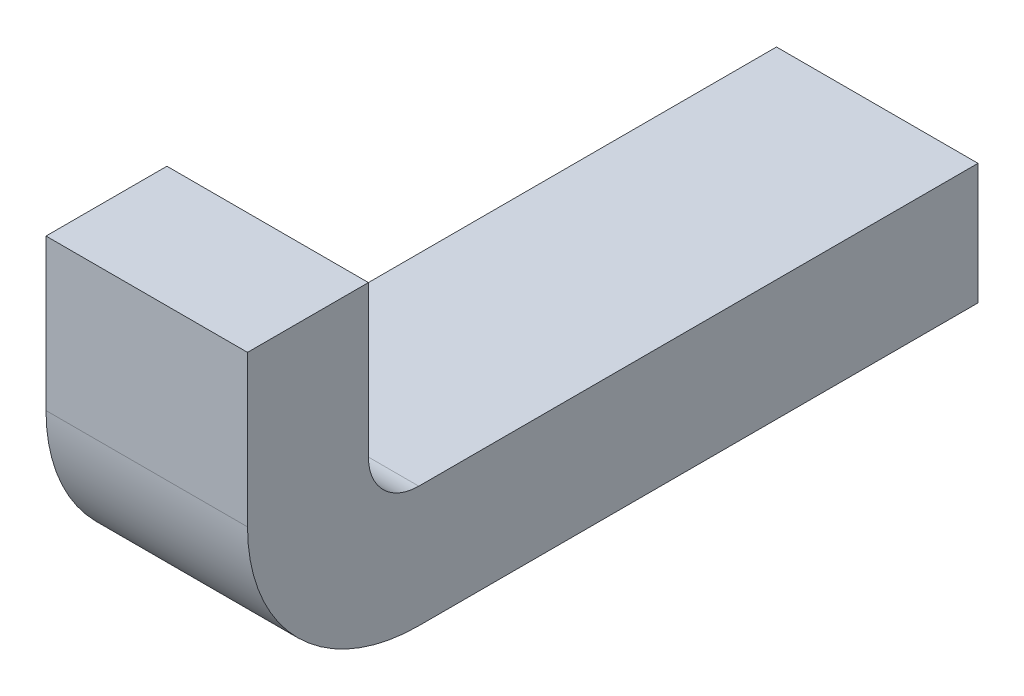
ISO-10303-21;
HEADER;
FILE_DESCRIPTION(('STEP AP214'),'2;1');
FILE_NAME('part.step','',(''),(''),'','','');
FILE_SCHEMA(('AUTOMOTIVE_DESIGN { 1 0 10303 214 1 1 1 1 }'));
ENDSEC;
DATA;
#1=APPLICATION_CONTEXT('core data for automotive mechanical design processes');
#2=APPLICATION_PROTOCOL_DEFINITION('international standard','automotive_design',2000,#1);
#3=PRODUCT_CONTEXT('',#1,'mechanical');
#4=PRODUCT('Part','Part','',(#3));
#5=PRODUCT_RELATED_PRODUCT_CATEGORY('part','',(#4));
#6=PRODUCT_DEFINITION_FORMATION('','',#4);
#7=PRODUCT_DEFINITION_CONTEXT('part definition',#1,'design');
#8=PRODUCT_DEFINITION('design','',#6,#7);
#9=PRODUCT_DEFINITION_SHAPE('','',#8);
#10=(LENGTH_UNIT() NAMED_UNIT(*) SI_UNIT(.MILLI.,.METRE.));
#11=(NAMED_UNIT(*) PLANE_ANGLE_UNIT() SI_UNIT($,.RADIAN.));
#12=(NAMED_UNIT(*) SI_UNIT($,.STERADIAN.) SOLID_ANGLE_UNIT());
#13=UNCERTAINTY_MEASURE_WITH_UNIT(LENGTH_MEASURE(1.E-05),#10,'distance_accuracy_value','');
#14=(GEOMETRIC_REPRESENTATION_CONTEXT(3) GLOBAL_UNCERTAINTY_ASSIGNED_CONTEXT((#13)) GLOBAL_UNIT_ASSIGNED_CONTEXT((#10,
#11,#12)) REPRESENTATION_CONTEXT('',''));
#15=CARTESIAN_POINT('',(0.,0.,0.));
#16=DIRECTION('',(0.,0.,1.));
#17=DIRECTION('',(1.,0.,0.));
#18=AXIS2_PLACEMENT_3D('',#15,#16,#17);
#19=CARTESIAN_POINT('',(-0.85,0.,-3.300000000002));
#20=DIRECTION('',(0.,-1.,0.));
#21=DIRECTION('',(1.,0.,0.));
#22=AXIS2_PLACEMENT_3D('',#19,#20,#21);
#23=PLANE('',#22);
#24=DIRECTION('',(0.,0.,1.));
#25=VECTOR('',#24,1.);
#26=CARTESIAN_POINT('',(-0.85,0.,-3.300000000002));
#27=LINE('',#26,#25);
#28=CARTESIAN_POINT('',(-0.85,0.,-3.300000000002));
#29=VERTEX_POINT('',#28);
#30=CARTESIAN_POINT('',(-0.85,0.,-3.854999999999));
#31=VERTEX_POINT('',#30);
#32=EDGE_CURVE('E121',#29,#31,#27,.F.);
#33=ORIENTED_EDGE('',*,*,#32,.T.);
#34=DIRECTION('',(-1.,0.,0.));
#35=VECTOR('',#34,1.);
#36=CARTESIAN_POINT('',(-0.85,0.,-3.854999999999));
#37=LINE('',#36,#35);
#38=CARTESIAN_POINT('',(-0.65,0.,-3.854999999999));
#39=VERTEX_POINT('',#38);
#40=EDGE_CURVE('E124',#39,#31,#37,.T.);
#41=ORIENTED_EDGE('',*,*,#40,.F.);
#42=DIRECTION('',(0.,0.,1.));
#43=VECTOR('',#42,1.);
#44=CARTESIAN_POINT('',(-0.65,0.,-3.300000000002));
#45=LINE('',#44,#43);
#46=CARTESIAN_POINT('',(-0.65,0.,-3.300000000002));
#47=VERTEX_POINT('',#46);
#48=EDGE_CURVE('E154',#47,#39,#45,.F.);
#49=ORIENTED_EDGE('',*,*,#48,.F.);
#50=DIRECTION('',(1.,0.,0.));
#51=VECTOR('',#50,1.);
#52=CARTESIAN_POINT('',(-0.85,0.,-3.300000000002));
#53=LINE('',#52,#51);
#54=EDGE_CURVE('E63',#29,#47,#53,.T.);
#55=ORIENTED_EDGE('',*,*,#54,.F.);
#56=EDGE_LOOP('',(#33,#41,#49,#55));
#57=FACE_BOUND('',#56,.T.);
#58=ADVANCED_FACE('F16',(#57),#23,.T.);
#59=CARTESIAN_POINT('',(-0.85,0.32,-3.250000000002));
#60=DIRECTION('',(0.,1.,1.246832498358E-13));
#61=DIRECTION('',(0.,-1.246832498358E-13,1.));
#62=AXIS2_PLACEMENT_3D('',#59,#60,#61);
#63=PLANE('',#62);
#64=DIRECTION('',(0.,0.,1.));
#65=VECTOR('',#64,1.);
#66=CARTESIAN_POINT('',(-0.85,0.32,-3.300000000002));
#67=LINE('',#66,#65);
#68=CARTESIAN_POINT('',(-0.85,0.32,-3.250000000002));
#69=VERTEX_POINT('',#68);
#70=CARTESIAN_POINT('',(-0.85,0.32,-3.130000000002));
#71=VERTEX_POINT('',#70);
#72=EDGE_CURVE('E100',#69,#71,#67,.T.);
#73=ORIENTED_EDGE('',*,*,#72,.T.);
#74=DIRECTION('',(1.,0.,0.));
#75=VECTOR('',#74,1.);
#76=CARTESIAN_POINT('',(-0.85,0.32,-3.130000000002));
#77=LINE('',#76,#75);
#78=CARTESIAN_POINT('',(-0.65,0.32,-3.130000000002));
#79=VERTEX_POINT('',#78);
#80=EDGE_CURVE('E162',#79,#71,#77,.F.);
#81=ORIENTED_EDGE('',*,*,#80,.F.);
#82=DIRECTION('',(0.,0.,1.));
#83=VECTOR('',#82,1.);
#84=CARTESIAN_POINT('',(-0.65,0.32,-3.300000000002));
#85=LINE('',#84,#83);
#86=CARTESIAN_POINT('',(-0.65,0.32,-3.250000000002));
#87=VERTEX_POINT('',#86);
#88=EDGE_CURVE('E150',#87,#79,#85,.T.);
#89=ORIENTED_EDGE('',*,*,#88,.F.);
#90=DIRECTION('',(-1.,0.,0.));
#91=VECTOR('',#90,1.);
#92=CARTESIAN_POINT('',(-0.85,0.32,-3.250000000002));
#93=LINE('',#92,#91);
#94=EDGE_CURVE('E72',#69,#87,#93,.F.);
#95=ORIENTED_EDGE('',*,*,#94,.F.);
#96=EDGE_LOOP('',(#73,#81,#89,#95));
#97=FACE_BOUND('',#96,.T.);
#98=ADVANCED_FACE('F182',(#97),#63,.T.);
#99=CARTESIAN_POINT('',(-0.85,0.32,-3.130000000002));
#100=DIRECTION('',(0.,0.,1.));
#101=DIRECTION('',(1.,0.,0.));
#102=AXIS2_PLACEMENT_3D('',#99,#100,#101);
#103=PLANE('',#102);
#104=DIRECTION('',(0.,1.,0.));
#105=VECTOR('',#104,1.);
#106=CARTESIAN_POINT('',(-0.85,0.17,-3.130000000002));
#107=LINE('',#106,#105);
#108=CARTESIAN_POINT('',(-0.85,0.17,-3.130000000002));
#109=VERTEX_POINT('',#108);
#110=EDGE_CURVE('E110',#71,#109,#107,.F.);
#111=ORIENTED_EDGE('',*,*,#110,.T.);
#112=DIRECTION('',(1.,0.,0.));
#113=VECTOR('',#112,1.);
#114=CARTESIAN_POINT('',(-0.85,0.17,-3.130000000002));
#115=LINE('',#114,#113);
#116=CARTESIAN_POINT('',(-0.65,0.17,-3.130000000002));
#117=VERTEX_POINT('',#116);
#118=EDGE_CURVE('E57',#117,#109,#115,.F.);
#119=ORIENTED_EDGE('',*,*,#118,.F.);
#120=DIRECTION('',(0.,1.,0.));
#121=VECTOR('',#120,1.);
#122=CARTESIAN_POINT('',(-0.65,0.17,-3.130000000002));
#123=LINE('',#122,#121);
#124=EDGE_CURVE('E141',#79,#117,#123,.F.);
#125=ORIENTED_EDGE('',*,*,#124,.F.);
#126=ORIENTED_EDGE('',*,*,#80,.T.);
#127=EDGE_LOOP('',(#111,#119,#125,#126));
#128=FACE_BOUND('',#127,.T.);
#129=ADVANCED_FACE('F183',(#128),#103,.T.);
#130=CARTESIAN_POINT('',(-0.85,0.17,-3.300000000002));
#131=DIRECTION('',(1.,0.,0.));
#132=DIRECTION('',(0.,1.,0.));
#133=AXIS2_PLACEMENT_3D('',#130,#131,#132);
#134=CYLINDRICAL_SURFACE('',#133,0.17);
#135=CARTESIAN_POINT('',(-0.85,0.17,-3.300000000002));
#136=DIRECTION('',(1.,0.,0.));
#137=DIRECTION('',(0.,1.,0.));
#138=AXIS2_PLACEMENT_3D('',#135,#136,#137);
#139=CIRCLE('',#138,0.17);
#140=EDGE_CURVE('E96',#109,#29,#139,.T.);
#141=ORIENTED_EDGE('',*,*,#140,.T.);
#142=ORIENTED_EDGE('',*,*,#54,.T.);
#143=CARTESIAN_POINT('',(-0.65,0.17,-3.300000000002));
#144=DIRECTION('',(1.,0.,0.));
#145=DIRECTION('',(0.,1.,0.));
#146=AXIS2_PLACEMENT_3D('',#143,#144,#145);
#147=CIRCLE('',#146,0.17);
#148=EDGE_CURVE('E19',#117,#47,#147,.T.);
#149=ORIENTED_EDGE('',*,*,#148,.F.);
#150=ORIENTED_EDGE('',*,*,#118,.T.);
#151=EDGE_LOOP('',(#141,#142,#149,#150));
#152=FACE_BOUND('',#151,.T.);
#153=ADVANCED_FACE('F185',(#152),#134,.T.);
#154=CARTESIAN_POINT('',(-0.85,0.17,-3.250000000002));
#155=DIRECTION('',(0.,0.,-1.));
#156=DIRECTION('',(-1.,0.,0.));
#157=AXIS2_PLACEMENT_3D('',#154,#155,#156);
#158=PLANE('',#157);
#159=DIRECTION('',(0.,1.,0.));
#160=VECTOR('',#159,1.);
#161=CARTESIAN_POINT('',(-0.85,0.17,-3.250000000002));
#162=LINE('',#161,#160);
#163=CARTESIAN_POINT('',(-0.85,0.17,-3.250000000002));
#164=VERTEX_POINT('',#163);
#165=EDGE_CURVE('E92',#164,#69,#162,.T.);
#166=ORIENTED_EDGE('',*,*,#165,.T.);
#167=ORIENTED_EDGE('',*,*,#94,.T.);
#168=DIRECTION('',(0.,1.,0.));
#169=VECTOR('',#168,1.);
#170=CARTESIAN_POINT('',(-0.65,0.17,-3.250000000002));
#171=LINE('',#170,#169);
#172=CARTESIAN_POINT('',(-0.65,0.17,-3.250000000002));
#173=VERTEX_POINT('',#172);
#174=EDGE_CURVE('E87',#173,#87,#171,.T.);
#175=ORIENTED_EDGE('',*,*,#174,.F.);
#176=DIRECTION('',(1.,0.,0.));
#177=VECTOR('',#176,1.);
#178=CARTESIAN_POINT('',(-0.85,0.17,-3.250000000002));
#179=LINE('',#178,#177);
#180=EDGE_CURVE('E90',#173,#164,#179,.F.);
#181=ORIENTED_EDGE('',*,*,#180,.T.);
#182=EDGE_LOOP('',(#166,#167,#175,#181));
#183=FACE_BOUND('',#182,.T.);
#184=ADVANCED_FACE('F91',(#183),#158,.T.);
#185=CARTESIAN_POINT('',(-0.65,0.17,-3.300000000002));
#186=DIRECTION('',(1.,0.,0.));
#187=DIRECTION('',(0.,1.,0.));
#188=AXIS2_PLACEMENT_3D('',#185,#186,#187);
#189=PLANE('',#188);
#190=ORIENTED_EDGE('',*,*,#88,.T.);
#191=ORIENTED_EDGE('',*,*,#124,.T.);
#192=ORIENTED_EDGE('',*,*,#148,.T.);
#193=ORIENTED_EDGE('',*,*,#48,.T.);
#194=DIRECTION('',(0.,1.,0.));
#195=VECTOR('',#194,1.);
#196=CARTESIAN_POINT('',(-0.65,0.,-3.854999999999));
#197=LINE('',#196,#195);
#198=CARTESIAN_POINT('',(-0.65,0.12,-3.854999999999));
#199=VERTEX_POINT('',#198);
#200=EDGE_CURVE('E138',#199,#39,#197,.F.);
#201=ORIENTED_EDGE('',*,*,#200,.F.);
#202=DIRECTION('',(0.,0.,1.));
#203=VECTOR('',#202,1.);
#204=CARTESIAN_POINT('',(-0.65,0.12,-3.854999999999));
#205=LINE('',#204,#203);
#206=CARTESIAN_POINT('',(-0.65,0.119999999999999,-3.300000000002));
#207=VERTEX_POINT('',#206);
#208=EDGE_CURVE('E107',#207,#199,#205,.F.);
#209=ORIENTED_EDGE('',*,*,#208,.F.);
#210=CARTESIAN_POINT('',(-0.65,0.17,-3.300000000002));
#211=DIRECTION('',(1.,0.,0.));
#212=DIRECTION('',(0.,1.,0.));
#213=AXIS2_PLACEMENT_3D('',#210,#211,#212);
#214=CIRCLE('',#213,0.05);
#215=EDGE_CURVE('E105',#207,#173,#214,.F.);
#216=ORIENTED_EDGE('',*,*,#215,.T.);
#217=ORIENTED_EDGE('',*,*,#174,.T.);
#218=EDGE_LOOP('',(#190,#191,#192,#193,#201,#209,#216,#217));
#219=FACE_BOUND('',#218,.T.);
#220=ADVANCED_FACE('F179',(#219),#189,.T.);
#221=CARTESIAN_POINT('',(-0.85,0.,-3.854999999999));
#222=DIRECTION('',(0.,0.,-1.));
#223=DIRECTION('',(-1.,0.,0.));
#224=AXIS2_PLACEMENT_3D('',#221,#222,#223);
#225=PLANE('',#224);
#226=DIRECTION('',(0.,1.,0.));
#227=VECTOR('',#226,1.);
#228=CARTESIAN_POINT('',(-0.85,0.17,-3.854999999999));
#229=LINE('',#228,#227);
#230=CARTESIAN_POINT('',(-0.85,0.12,-3.854999999999));
#231=VERTEX_POINT('',#230);
#232=EDGE_CURVE('E101',#31,#231,#229,.T.);
#233=ORIENTED_EDGE('',*,*,#232,.T.);
#234=DIRECTION('',(-1.,0.,0.));
#235=VECTOR('',#234,1.);
#236=CARTESIAN_POINT('',(-0.85,0.12,-3.854999999999));
#237=LINE('',#236,#235);
#238=EDGE_CURVE('E128',#199,#231,#237,.T.);
#239=ORIENTED_EDGE('',*,*,#238,.F.);
#240=ORIENTED_EDGE('',*,*,#200,.T.);
#241=ORIENTED_EDGE('',*,*,#40,.T.);
#242=EDGE_LOOP('',(#233,#239,#240,#241));
#243=FACE_BOUND('',#242,.T.);
#244=ADVANCED_FACE('F204',(#243),#225,.T.);
#245=CARTESIAN_POINT('',(-0.85,0.17,-3.300000000002));
#246=DIRECTION('',(1.,0.,0.));
#247=DIRECTION('',(0.,1.,0.));
#248=AXIS2_PLACEMENT_3D('',#245,#246,#247);
#249=PLANE('',#248);
#250=ORIENTED_EDGE('',*,*,#110,.F.);
#251=ORIENTED_EDGE('',*,*,#72,.F.);
#252=ORIENTED_EDGE('',*,*,#165,.F.);
#253=CARTESIAN_POINT('',(-0.85,0.17,-3.300000000002));
#254=DIRECTION('',(1.,0.,0.));
#255=DIRECTION('',(0.,1.,0.));
#256=AXIS2_PLACEMENT_3D('',#253,#254,#255);
#257=CIRCLE('',#256,0.05);
#258=CARTESIAN_POINT('',(-0.85,0.12,-3.300000000002));
#259=VERTEX_POINT('',#258);
#260=EDGE_CURVE('E34',#164,#259,#257,.T.);
#261=ORIENTED_EDGE('',*,*,#260,.T.);
#262=DIRECTION('',(0.,0.,1.));
#263=VECTOR('',#262,1.);
#264=CARTESIAN_POINT('',(-0.85,0.12,-3.854999999999));
#265=LINE('',#264,#263);
#266=EDGE_CURVE('E25',#231,#259,#265,.T.);
#267=ORIENTED_EDGE('',*,*,#266,.F.);
#268=ORIENTED_EDGE('',*,*,#232,.F.);
#269=ORIENTED_EDGE('',*,*,#32,.F.);
#270=ORIENTED_EDGE('',*,*,#140,.F.);
#271=EDGE_LOOP('',(#250,#251,#252,#261,#267,#268,#269,#270));
#272=FACE_BOUND('',#271,.T.);
#273=ADVANCED_FACE('F99',(#272),#249,.F.);
#274=CARTESIAN_POINT('',(-0.85,0.17,-3.300000000002));
#275=DIRECTION('',(1.,0.,0.));
#276=DIRECTION('',(0.,1.,0.));
#277=AXIS2_PLACEMENT_3D('',#274,#275,#276);
#278=CYLINDRICAL_SURFACE('',#277,0.05);
#279=DIRECTION('',(-1.,0.,0.));
#280=VECTOR('',#279,1.);
#281=CARTESIAN_POINT('',(-0.85,0.12,-3.300000000002));
#282=LINE('',#281,#280);
#283=EDGE_CURVE('E11',#259,#207,#282,.F.);
#284=ORIENTED_EDGE('',*,*,#283,.F.);
#285=ORIENTED_EDGE('',*,*,#260,.F.);
#286=ORIENTED_EDGE('',*,*,#180,.F.);
#287=ORIENTED_EDGE('',*,*,#215,.F.);
#288=EDGE_LOOP('',(#284,#285,#286,#287));
#289=FACE_BOUND('',#288,.T.);
#290=ADVANCED_FACE('F103',(#289),#278,.F.);
#291=CARTESIAN_POINT('',(-0.85,0.12,-3.854999999999));
#292=DIRECTION('',(0.,1.,0.));
#293=DIRECTION('',(-1.,0.,0.));
#294=AXIS2_PLACEMENT_3D('',#291,#292,#293);
#295=PLANE('',#294);
#296=ORIENTED_EDGE('',*,*,#266,.T.);
#297=ORIENTED_EDGE('',*,*,#283,.T.);
#298=ORIENTED_EDGE('',*,*,#208,.T.);
#299=ORIENTED_EDGE('',*,*,#238,.T.);
#300=EDGE_LOOP('',(#296,#297,#298,#299));
#301=FACE_BOUND('',#300,.T.);
#302=ADVANCED_FACE('F193',(#301),#295,.T.);
#303=CLOSED_SHELL('',(#58,#98,#129,#153,#184,#220,#244,#273,#290,#302));
#304=MANIFOLD_SOLID_BREP('B1',#303);
#305=ADVANCED_BREP_SHAPE_REPRESENTATION('',(#18,#304),#14);
#306=SHAPE_DEFINITION_REPRESENTATION(#9,#305);
ENDSEC;
END-ISO-10303-21;
